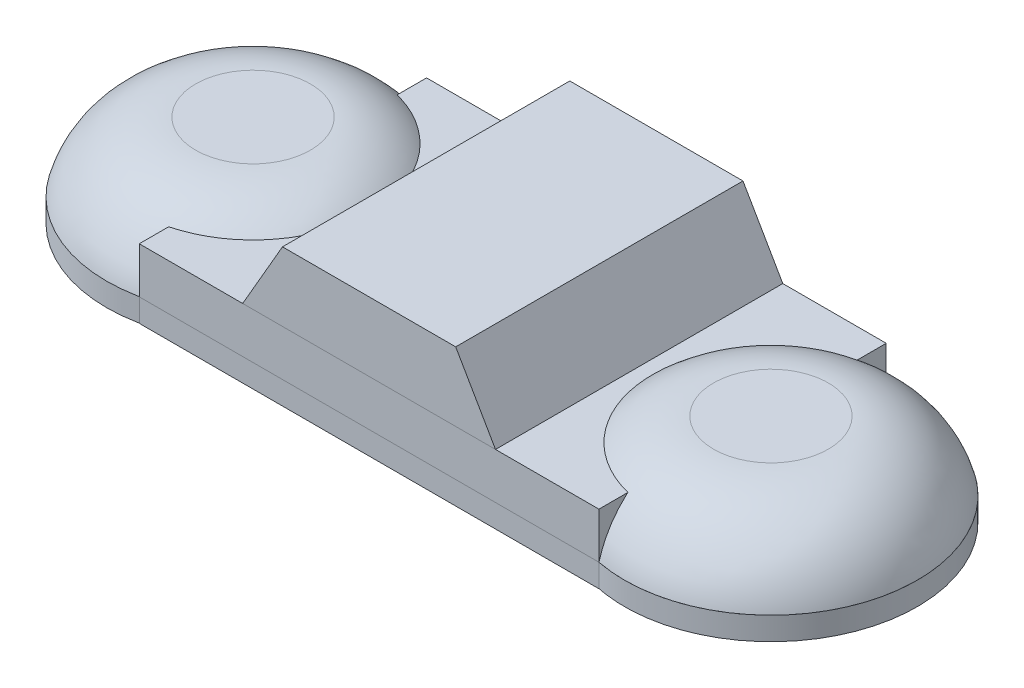
ISO-10303-21;
HEADER;
FILE_DESCRIPTION(('STEP AP214'),'2;1');
FILE_NAME('part.step','',(''),(''),'','','');
FILE_SCHEMA(('AUTOMOTIVE_DESIGN { 1 0 10303 214 1 1 1 1 }'));
ENDSEC;
DATA;
#1=APPLICATION_CONTEXT('core data for automotive mechanical design processes');
#2=APPLICATION_PROTOCOL_DEFINITION('international standard','automotive_design',2000,#1);
#3=PRODUCT_CONTEXT('',#1,'mechanical');
#4=PRODUCT('Part','Part','',(#3));
#5=PRODUCT_RELATED_PRODUCT_CATEGORY('part','',(#4));
#6=PRODUCT_DEFINITION_FORMATION('','',#4);
#7=PRODUCT_DEFINITION_CONTEXT('part definition',#1,'design');
#8=PRODUCT_DEFINITION('design','',#6,#7);
#9=PRODUCT_DEFINITION_SHAPE('','',#8);
#10=(LENGTH_UNIT() NAMED_UNIT(*) SI_UNIT(.MILLI.,.METRE.));
#11=(NAMED_UNIT(*) PLANE_ANGLE_UNIT() SI_UNIT($,.RADIAN.));
#12=(NAMED_UNIT(*) SI_UNIT($,.STERADIAN.) SOLID_ANGLE_UNIT());
#13=UNCERTAINTY_MEASURE_WITH_UNIT(LENGTH_MEASURE(1.E-05),#10,'distance_accuracy_value','');
#14=(GEOMETRIC_REPRESENTATION_CONTEXT(3) GLOBAL_UNCERTAINTY_ASSIGNED_CONTEXT((#13)) GLOBAL_UNIT_ASSIGNED_CONTEXT((#10,
#11,#12)) REPRESENTATION_CONTEXT('',''));
#15=CARTESIAN_POINT('',(0.,0.,0.));
#16=DIRECTION('',(0.,0.,1.));
#17=DIRECTION('',(1.,0.,0.));
#18=AXIS2_PLACEMENT_3D('',#15,#16,#17);
#19=CARTESIAN_POINT('',(0.553239919106996,0.6,-0.620777237110548));
#20=DIRECTION('',(0.,0.,1.));
#21=DIRECTION('',(1.,0.,0.));
#22=AXIS2_PLACEMENT_3D('',#19,#20,#21);
#23=PLANE('',#22);
#24=DIRECTION('',(-1.,0.,0.));
#25=VECTOR('',#24,1.);
#26=CARTESIAN_POINT('',(0.553239919106996,0.3,-0.620777237110548));
#27=LINE('',#26,#25);
#28=CARTESIAN_POINT('',(0.553239919106996,0.3,-0.620777237110548));
#29=VERTEX_POINT('',#28);
#30=CARTESIAN_POINT('',(-0.546760080893004,0.3,-0.620777237110548));
#31=VERTEX_POINT('',#30);
#32=EDGE_CURVE('E91',#29,#31,#27,.T.);
#33=ORIENTED_EDGE('',*,*,#32,.T.);
#34=DIRECTION('',(0.499999999999998,0.86602540378444,0.));
#35=VECTOR('',#34,1.);
#36=CARTESIAN_POINT('',(-0.373555000136117,0.6,-0.620777237110548));
#37=LINE('',#36,#35);
#38=CARTESIAN_POINT('',(-0.373555000136117,0.6,-0.620777237110548));
#39=VERTEX_POINT('',#38);
#40=EDGE_CURVE('E12',#31,#39,#37,.T.);
#41=ORIENTED_EDGE('',*,*,#40,.T.);
#42=DIRECTION('',(-1.,0.,0.));
#43=VECTOR('',#42,1.);
#44=CARTESIAN_POINT('',(0.553239919106996,0.6,-0.620777237110548));
#45=LINE('',#44,#43);
#46=CARTESIAN_POINT('',(0.380034838350108,0.6,-0.620777237110548));
#47=VERTEX_POINT('',#46);
#48=EDGE_CURVE('E113',#47,#39,#45,.T.);
#49=ORIENTED_EDGE('',*,*,#48,.F.);
#50=DIRECTION('',(0.499999999999998,-0.86602540378444,0.));
#51=VECTOR('',#50,1.);
#52=CARTESIAN_POINT('',(0.380034838350108,0.6,-0.620777237110548));
#53=LINE('',#52,#51);
#54=EDGE_CURVE('E53',#47,#29,#53,.T.);
#55=ORIENTED_EDGE('',*,*,#54,.T.);
#56=EDGE_LOOP('',(#33,#41,#49,#55));
#57=FACE_BOUND('',#56,.T.);
#58=ADVANCED_FACE('F45',(#57),#23,.F.);
#59=CARTESIAN_POINT('',(0.553239919106996,0.6,0.629222762889452));
#60=DIRECTION('',(0.,0.,-1.));
#61=DIRECTION('',(-1.,0.,0.));
#62=AXIS2_PLACEMENT_3D('',#59,#60,#61);
#63=PLANE('',#62);
#64=DIRECTION('',(1.,0.,0.));
#65=VECTOR('',#64,1.);
#66=CARTESIAN_POINT('',(0.553239919106996,0.6,0.629222762889452));
#67=LINE('',#66,#65);
#68=CARTESIAN_POINT('',(-0.373555000136116,0.6,0.629222762889452));
#69=VERTEX_POINT('',#68);
#70=CARTESIAN_POINT('',(0.380034838350108,0.6,0.629222762889452));
#71=VERTEX_POINT('',#70);
#72=EDGE_CURVE('E107',#69,#71,#67,.T.);
#73=ORIENTED_EDGE('',*,*,#72,.F.);
#74=DIRECTION('',(-0.499999999999998,-0.86602540378444,0.));
#75=VECTOR('',#74,1.);
#76=CARTESIAN_POINT('',(-0.373555000136116,0.6,0.629222762889452));
#77=LINE('',#76,#75);
#78=CARTESIAN_POINT('',(-0.546760080893004,0.3,0.629222762889452));
#79=VERTEX_POINT('',#78);
#80=EDGE_CURVE('E68',#69,#79,#77,.T.);
#81=ORIENTED_EDGE('',*,*,#80,.T.);
#82=DIRECTION('',(1.,0.,0.));
#83=VECTOR('',#82,1.);
#84=CARTESIAN_POINT('',(0.553239919106996,0.3,0.629222762889452));
#85=LINE('',#84,#83);
#86=CARTESIAN_POINT('',(0.553239919106996,0.3,0.629222762889452));
#87=VERTEX_POINT('',#86);
#88=EDGE_CURVE('E93',#79,#87,#85,.T.);
#89=ORIENTED_EDGE('',*,*,#88,.T.);
#90=DIRECTION('',(-0.499999999999998,0.86602540378444,0.));
#91=VECTOR('',#90,1.);
#92=CARTESIAN_POINT('',(0.380034838350108,0.6,0.629222762889452));
#93=LINE('',#92,#91);
#94=EDGE_CURVE('E60',#87,#71,#93,.T.);
#95=ORIENTED_EDGE('',*,*,#94,.T.);
#96=EDGE_LOOP('',(#73,#81,#89,#95));
#97=FACE_BOUND('',#96,.T.);
#98=ADVANCED_FACE('F111',(#97),#63,.F.);
#99=CARTESIAN_POINT('',(0.,0.6,0.));
#100=DIRECTION('',(0.,1.,0.));
#101=DIRECTION('',(0.,0.,1.));
#102=AXIS2_PLACEMENT_3D('',#99,#100,#101);
#103=PLANE('',#102);
#104=ORIENTED_EDGE('',*,*,#48,.T.);
#105=DIRECTION('',(0.,0.,1.));
#106=VECTOR('',#105,1.);
#107=CARTESIAN_POINT('',(-0.373555000136116,0.6,0.629222762889452));
#108=LINE('',#107,#106);
#109=EDGE_CURVE('E101',#39,#69,#108,.T.);
#110=ORIENTED_EDGE('',*,*,#109,.T.);
#111=ORIENTED_EDGE('',*,*,#72,.T.);
#112=DIRECTION('',(0.,0.,-1.));
#113=VECTOR('',#112,1.);
#114=CARTESIAN_POINT('',(0.380034838350108,0.6,-0.620777237110548));
#115=LINE('',#114,#113);
#116=EDGE_CURVE('E103',#71,#47,#115,.T.);
#117=ORIENTED_EDGE('',*,*,#116,.T.);
#118=EDGE_LOOP('',(#104,#110,#111,#117));
#119=FACE_BOUND('',#118,.T.);
#120=ADVANCED_FACE('F119',(#119),#103,.T.);
#121=CARTESIAN_POINT('',(0.,0.3,0.));
#122=DIRECTION('',(0.,1.,0.));
#123=DIRECTION('',(0.,0.,1.));
#124=AXIS2_PLACEMENT_3D('',#121,#122,#123);
#125=PLANE('',#124);
#126=ORIENTED_EDGE('',*,*,#32,.F.);
#127=DIRECTION('',(0.,0.,-1.));
#128=VECTOR('',#127,1.);
#129=CARTESIAN_POINT('',(0.553239919106996,0.3,0.629222762889452));
#130=LINE('',#129,#128);
#131=EDGE_CURVE('E115',#87,#29,#130,.T.);
#132=ORIENTED_EDGE('',*,*,#131,.F.);
#133=ORIENTED_EDGE('',*,*,#88,.F.);
#134=DIRECTION('',(0.,0.,1.));
#135=VECTOR('',#134,1.);
#136=CARTESIAN_POINT('',(-0.546760080893004,0.3,-0.620777237110548));
#137=LINE('',#136,#135);
#138=EDGE_CURVE('E87',#31,#79,#137,.T.);
#139=ORIENTED_EDGE('',*,*,#138,.F.);
#140=EDGE_LOOP('',(#126,#132,#133,#139));
#141=FACE_BOUND('',#140,.T.);
#142=ADVANCED_FACE('F89',(#141),#125,.F.);
#143=CARTESIAN_POINT('',(-0.373555000136116,0.6,0.));
#144=DIRECTION('',(-0.86602540378444,0.499999999999998,0.));
#145=DIRECTION('',(0.,0.,-1.));
#146=AXIS2_PLACEMENT_3D('',#143,#144,#145);
#147=PLANE('',#146);
#148=ORIENTED_EDGE('',*,*,#40,.F.);
#149=ORIENTED_EDGE('',*,*,#138,.T.);
#150=ORIENTED_EDGE('',*,*,#80,.F.);
#151=ORIENTED_EDGE('',*,*,#109,.F.);
#152=EDGE_LOOP('',(#148,#149,#150,#151));
#153=FACE_BOUND('',#152,.T.);
#154=ADVANCED_FACE('F100',(#153),#147,.T.);
#155=CARTESIAN_POINT('',(0.380034838350108,0.6,0.));
#156=DIRECTION('',(0.86602540378444,0.499999999999998,0.));
#157=DIRECTION('',(0.,0.,1.));
#158=AXIS2_PLACEMENT_3D('',#155,#156,#157);
#159=PLANE('',#158);
#160=ORIENTED_EDGE('',*,*,#94,.F.);
#161=ORIENTED_EDGE('',*,*,#131,.T.);
#162=ORIENTED_EDGE('',*,*,#54,.F.);
#163=ORIENTED_EDGE('',*,*,#116,.F.);
#164=EDGE_LOOP('',(#160,#161,#162,#163));
#165=FACE_BOUND('',#164,.T.);
#166=ADVANCED_FACE('F47',(#165),#159,.T.);
#167=CLOSED_SHELL('',(#58,#98,#120,#142,#154,#166));
#168=MANIFOLD_SOLID_BREP('B2',#167);
#169=CARTESIAN_POINT('',(-1.12663918547376,0.4,0.00422276288945236));
#170=DIRECTION('',(0.,1.,0.));
#171=DIRECTION('',(0.,0.,1.));
#172=AXIS2_PLACEMENT_3D('',#169,#170,#171);
#173=PLANE('',#172);
#174=CARTESIAN_POINT('',(-1.12663918547376,0.4,0.00422276288945236));
#175=DIRECTION('',(0.,1.,0.));
#176=DIRECTION('',(0.,0.,1.));
#177=AXIS2_PLACEMENT_3D('',#174,#175,#176);
#178=CIRCLE('',#177,0.249767108595147);
#179=CARTESIAN_POINT('',(-1.12663918547376,0.4,0.253989871484599));
#180=VERTEX_POINT('',#179);
#181=EDGE_CURVE('E44',#180,#180,#178,.T.);
#182=ORIENTED_EDGE('',*,*,#181,.T.);
#183=EDGE_LOOP('',(#182));
#184=FACE_BOUND('',#183,.T.);
#185=ADVANCED_FACE('F178',(#184),#173,.T.);
#186=CARTESIAN_POINT('',(-1.12663918547376,0.1,0.00422276288945236));
#187=DIRECTION('',(0.,1.,0.));
#188=DIRECTION('',(0.,0.,1.));
#189=AXIS2_PLACEMENT_3D('',#186,#187,#188);
#190=PLANE('',#189);
#191=CARTESIAN_POINT('',(-1.12663918547376,0.1,0.00422276288945236));
#192=DIRECTION('',(0.,1.,0.));
#193=DIRECTION('',(0.,0.,1.));
#194=AXIS2_PLACEMENT_3D('',#191,#192,#193);
#195=CIRCLE('',#194,0.637065443215888);
#196=CARTESIAN_POINT('',(-1.12663918547376,0.1,0.641288206105341));
#197=VERTEX_POINT('',#196);
#198=EDGE_CURVE('E185',#197,#197,#195,.T.);
#199=ORIENTED_EDGE('',*,*,#198,.F.);
#200=EDGE_LOOP('',(#199));
#201=FACE_BOUND('',#200,.T.);
#202=ADVANCED_FACE('F193',(#201),#190,.F.);
#203=CARTESIAN_POINT('',(-1.12663918547376,0.,0.00422276288945236));
#204=DIRECTION('',(0.,-1.,0.));
#205=DIRECTION('',(0.,0.,-1.));
#206=AXIS2_PLACEMENT_3D('',#203,#204,#205);
#207=DEGENERATE_TOROIDAL_SURFACE('',#206,0.249767108595147,0.4,.T.);
#208=ORIENTED_EDGE('',*,*,#198,.T.);
#209=EDGE_LOOP('',(#208));
#210=FACE_BOUND('',#209,.T.);
#211=ORIENTED_EDGE('',*,*,#181,.F.);
#212=EDGE_LOOP('',(#211));
#213=FACE_BOUND('',#212,.T.);
#214=ADVANCED_FACE('F180',(#210,#213),#207,.T.);
#215=CLOSED_SHELL('',(#185,#202,#214));
#216=MANIFOLD_SOLID_BREP('B6',#215);
#217=CARTESIAN_POINT('',(1.12663918547376,0.4,0.00422276288945236));
#218=DIRECTION('',(0.,1.,0.));
#219=DIRECTION('',(0.,0.,1.));
#220=AXIS2_PLACEMENT_3D('',#217,#218,#219);
#221=PLANE('',#220);
#222=CARTESIAN_POINT('',(1.12663918547376,0.4,0.00422276288945236));
#223=DIRECTION('',(0.,1.,0.));
#224=DIRECTION('',(0.,0.,1.));
#225=AXIS2_PLACEMENT_3D('',#222,#223,#224);
#226=CIRCLE('',#225,0.249767108595147);
#227=CARTESIAN_POINT('',(1.12663918547376,0.4,0.253989871484599));
#228=VERTEX_POINT('',#227);
#229=EDGE_CURVE('E177',#228,#228,#226,.T.);
#230=ORIENTED_EDGE('',*,*,#229,.T.);
#231=EDGE_LOOP('',(#230));
#232=FACE_BOUND('',#231,.T.);
#233=ADVANCED_FACE('F228',(#232),#221,.T.);
#234=CARTESIAN_POINT('',(1.12663918547376,0.1,0.00422276288945236));
#235=DIRECTION('',(0.,1.,0.));
#236=DIRECTION('',(0.,0.,1.));
#237=AXIS2_PLACEMENT_3D('',#234,#235,#236);
#238=PLANE('',#237);
#239=CARTESIAN_POINT('',(1.12663918547376,0.1,0.00422276288945236));
#240=DIRECTION('',(0.,1.,0.));
#241=DIRECTION('',(0.,0.,1.));
#242=AXIS2_PLACEMENT_3D('',#239,#240,#241);
#243=CIRCLE('',#242,0.637065443215888);
#244=CARTESIAN_POINT('',(1.12663918547376,0.1,0.641288206105341));
#245=VERTEX_POINT('',#244);
#246=EDGE_CURVE('E235',#245,#245,#243,.T.);
#247=ORIENTED_EDGE('',*,*,#246,.F.);
#248=EDGE_LOOP('',(#247));
#249=FACE_BOUND('',#248,.T.);
#250=ADVANCED_FACE('F243',(#249),#238,.F.);
#251=CARTESIAN_POINT('',(1.12663918547376,0.,0.00422276288945236));
#252=DIRECTION('',(0.,-1.,0.));
#253=DIRECTION('',(0.,0.,-1.));
#254=AXIS2_PLACEMENT_3D('',#251,#252,#253);
#255=DEGENERATE_TOROIDAL_SURFACE('',#254,0.249767108595147,0.4,.T.);
#256=ORIENTED_EDGE('',*,*,#246,.T.);
#257=EDGE_LOOP('',(#256));
#258=FACE_BOUND('',#257,.T.);
#259=ORIENTED_EDGE('',*,*,#229,.F.);
#260=EDGE_LOOP('',(#259));
#261=FACE_BOUND('',#260,.T.);
#262=ADVANCED_FACE('F230',(#258,#261),#255,.T.);
#263=CLOSED_SHELL('',(#233,#250,#262));
#264=MANIFOLD_SOLID_BREP('B39',#263);
#265=CARTESIAN_POINT('',(1.153239919107,0.3,0.00422276288945236));
#266=DIRECTION('',(0.,-1.,0.));
#267=DIRECTION('',(0.,0.,-1.));
#268=AXIS2_PLACEMENT_3D('',#265,#266,#267);
#269=CYLINDRICAL_SURFACE('',#268,0.39999999976948);
#270=CARTESIAN_POINT('',(1.153239919107,0.1,0.00422276288945236));
#271=DIRECTION('',(0.,-1.,0.));
#272=DIRECTION('',(0.,0.,1.));
#273=AXIS2_PLACEMENT_3D('',#270,#271,#272);
#274=CIRCLE('',#273,0.39999999976948);
#275=CARTESIAN_POINT('',(1.003239919107,0.1,0.375032686995569));
#276=VERTEX_POINT('',#275);
#277=CARTESIAN_POINT('',(1.003239919107,0.1,-0.366587161216665));
#278=VERTEX_POINT('',#277);
#279=EDGE_CURVE('E372',#276,#278,#274,.T.);
#280=ORIENTED_EDGE('',*,*,#279,.T.);
#281=DIRECTION('',(0.,-1.,0.));
#282=VECTOR('',#281,1.);
#283=CARTESIAN_POINT('',(1.003239919107,0.3,-0.366587161216665));
#284=LINE('',#283,#282);
#285=CARTESIAN_POINT('',(1.003239919107,0.3,-0.366587161216665));
#286=VERTEX_POINT('',#285);
#287=EDGE_CURVE('E226',#286,#278,#284,.T.);
#288=ORIENTED_EDGE('',*,*,#287,.F.);
#289=CARTESIAN_POINT('',(1.153239919107,0.3,0.00422276288945236));
#290=DIRECTION('',(0.,-1.,0.));
#291=DIRECTION('',(0.,0.,1.));
#292=AXIS2_PLACEMENT_3D('',#289,#290,#291);
#293=CIRCLE('',#292,0.39999999976948);
#294=CARTESIAN_POINT('',(1.003239919107,0.3,0.375032686995569));
#295=VERTEX_POINT('',#294);
#296=EDGE_CURVE('E386',#295,#286,#293,.T.);
#297=ORIENTED_EDGE('',*,*,#296,.F.);
#298=DIRECTION('',(0.,-1.,0.));
#299=VECTOR('',#298,1.);
#300=CARTESIAN_POINT('',(1.003239919107,0.3,0.375032686995569));
#301=LINE('',#300,#299);
#302=EDGE_CURVE('E368',#295,#276,#301,.T.);
#303=ORIENTED_EDGE('',*,*,#302,.T.);
#304=EDGE_LOOP('',(#280,#288,#297,#303));
#305=FACE_BOUND('',#304,.T.);
#306=ADVANCED_FACE('F276',(#305),#269,.F.);
#307=CARTESIAN_POINT('',(1.003239919107,0.3,-0.366587161216665));
#308=DIRECTION('',(-1.,0.,0.));
#309=DIRECTION('',(0.,0.,1.));
#310=AXIS2_PLACEMENT_3D('',#307,#308,#309);
#311=PLANE('',#310);
#312=DIRECTION('',(0.,0.,-1.));
#313=VECTOR('',#312,1.);
#314=CARTESIAN_POINT('',(1.003239919107,0.1,-0.366587161216665));
#315=LINE('',#314,#313);
#316=CARTESIAN_POINT('',(1.003239919107,0.1,-0.620777237110548));
#317=VERTEX_POINT('',#316);
#318=EDGE_CURVE('E375',#278,#317,#315,.T.);
#319=ORIENTED_EDGE('',*,*,#318,.T.);
#320=DIRECTION('',(0.,-1.,0.));
#321=VECTOR('',#320,1.);
#322=CARTESIAN_POINT('',(1.003239919107,0.3,-0.620777237110548));
#323=LINE('',#322,#321);
#324=CARTESIAN_POINT('',(1.003239919107,0.3,-0.620777237110548));
#325=VERTEX_POINT('',#324);
#326=EDGE_CURVE('E284',#325,#317,#323,.T.);
#327=ORIENTED_EDGE('',*,*,#326,.F.);
#328=DIRECTION('',(0.,0.,-1.));
#329=VECTOR('',#328,1.);
#330=CARTESIAN_POINT('',(1.003239919107,0.3,-0.366587161216665));
#331=LINE('',#330,#329);
#332=EDGE_CURVE('E335',#286,#325,#331,.T.);
#333=ORIENTED_EDGE('',*,*,#332,.F.);
#334=ORIENTED_EDGE('',*,*,#287,.T.);
#335=EDGE_LOOP('',(#319,#327,#333,#334));
#336=FACE_BOUND('',#335,.T.);
#337=ADVANCED_FACE('F421',(#336),#311,.F.);
#338=CARTESIAN_POINT('',(1.003239919107,0.3,-0.620777237110548));
#339=DIRECTION('',(0.,0.,1.));
#340=DIRECTION('',(1.,0.,0.));
#341=AXIS2_PLACEMENT_3D('',#338,#339,#340);
#342=PLANE('',#341);
#343=DIRECTION('',(-1.,0.,0.));
#344=VECTOR('',#343,1.);
#345=CARTESIAN_POINT('',(1.003239919107,0.1,-0.620777237110548));
#346=LINE('',#345,#344);
#347=CARTESIAN_POINT('',(-0.996760080893004,0.1,-0.620777237110548));
#348=VERTEX_POINT('',#347);
#349=EDGE_CURVE('E377',#317,#348,#346,.T.);
#350=ORIENTED_EDGE('',*,*,#349,.T.);
#351=DIRECTION('',(0.,-1.,0.));
#352=VECTOR('',#351,1.);
#353=CARTESIAN_POINT('',(-0.996760080893004,0.3,-0.620777237110548));
#354=LINE('',#353,#352);
#355=CARTESIAN_POINT('',(-0.996760080893004,0.3,-0.620777237110548));
#356=VERTEX_POINT('',#355);
#357=EDGE_CURVE('E393',#356,#348,#354,.T.);
#358=ORIENTED_EDGE('',*,*,#357,.F.);
#359=DIRECTION('',(-1.,0.,0.));
#360=VECTOR('',#359,1.);
#361=CARTESIAN_POINT('',(1.003239919107,0.3,-0.620777237110548));
#362=LINE('',#361,#360);
#363=EDGE_CURVE('E401',#325,#356,#362,.T.);
#364=ORIENTED_EDGE('',*,*,#363,.F.);
#365=ORIENTED_EDGE('',*,*,#326,.T.);
#366=EDGE_LOOP('',(#350,#358,#364,#365));
#367=FACE_BOUND('',#366,.T.);
#368=ADVANCED_FACE('F399',(#367),#342,.F.);
#369=CARTESIAN_POINT('',(-0.996760080893004,0.3,-0.620777237110548));
#370=DIRECTION('',(1.,0.,0.));
#371=DIRECTION('',(0.,0.,-1.));
#372=AXIS2_PLACEMENT_3D('',#369,#370,#371);
#373=PLANE('',#372);
#374=DIRECTION('',(0.,0.,1.));
#375=VECTOR('',#374,1.);
#376=CARTESIAN_POINT('',(-0.996760080893004,0.1,-0.620777237110548));
#377=LINE('',#376,#375);
#378=CARTESIAN_POINT('',(-0.996760080893004,0.1,-0.365649228776321));
#379=VERTEX_POINT('',#378);
#380=EDGE_CURVE('E379',#348,#379,#377,.T.);
#381=ORIENTED_EDGE('',*,*,#380,.T.);
#382=DIRECTION('',(0.,-1.,0.));
#383=VECTOR('',#382,1.);
#384=CARTESIAN_POINT('',(-0.996760080893004,0.3,-0.365649228776321));
#385=LINE('',#384,#383);
#386=CARTESIAN_POINT('',(-0.996760080893004,0.3,-0.365649228776321));
#387=VERTEX_POINT('',#386);
#388=EDGE_CURVE('E390',#387,#379,#385,.T.);
#389=ORIENTED_EDGE('',*,*,#388,.F.);
#390=DIRECTION('',(0.,0.,1.));
#391=VECTOR('',#390,1.);
#392=CARTESIAN_POINT('',(-0.996760080893004,0.3,-0.620777237110548));
#393=LINE('',#392,#391);
#394=EDGE_CURVE('E413',#356,#387,#393,.T.);
#395=ORIENTED_EDGE('',*,*,#394,.F.);
#396=ORIENTED_EDGE('',*,*,#357,.T.);
#397=EDGE_LOOP('',(#381,#389,#395,#396));
#398=FACE_BOUND('',#397,.T.);
#399=ADVANCED_FACE('F409',(#398),#373,.F.);
#400=CARTESIAN_POINT('',(-1.146760080893,0.3,0.00422276288945236));
#401=DIRECTION('',(0.,-1.,0.));
#402=DIRECTION('',(0.,0.,-1.));
#403=AXIS2_PLACEMENT_3D('',#400,#401,#402);
#404=CYLINDRICAL_SURFACE('',#403,0.399130668101069);
#405=CARTESIAN_POINT('',(-1.146760080893,0.1,0.00422276288945236));
#406=DIRECTION('',(0.,-1.,0.));
#407=DIRECTION('',(0.,0.,1.));
#408=AXIS2_PLACEMENT_3D('',#405,#406,#407);
#409=CIRCLE('',#408,0.399130668101069);
#410=CARTESIAN_POINT('',(-0.996760080893004,0.1,0.374094754555226));
#411=VERTEX_POINT('',#410);
#412=EDGE_CURVE('E381',#379,#411,#409,.T.);
#413=ORIENTED_EDGE('',*,*,#412,.T.);
#414=DIRECTION('',(0.,-1.,0.));
#415=VECTOR('',#414,1.);
#416=CARTESIAN_POINT('',(-0.996760080893004,0.3,0.374094754555226));
#417=LINE('',#416,#415);
#418=CARTESIAN_POINT('',(-0.996760080893004,0.3,0.374094754555226));
#419=VERTEX_POINT('',#418);
#420=EDGE_CURVE('E363',#419,#411,#417,.T.);
#421=ORIENTED_EDGE('',*,*,#420,.F.);
#422=CARTESIAN_POINT('',(-1.146760080893,0.3,0.00422276288945236));
#423=DIRECTION('',(0.,-1.,0.));
#424=DIRECTION('',(0.,0.,1.));
#425=AXIS2_PLACEMENT_3D('',#422,#423,#424);
#426=CIRCLE('',#425,0.399130668101069);
#427=EDGE_CURVE('E354',#387,#419,#426,.T.);
#428=ORIENTED_EDGE('',*,*,#427,.F.);
#429=ORIENTED_EDGE('',*,*,#388,.T.);
#430=EDGE_LOOP('',(#413,#421,#428,#429));
#431=FACE_BOUND('',#430,.T.);
#432=ADVANCED_FACE('F412',(#431),#404,.F.);
#433=CARTESIAN_POINT('',(-0.996760080893004,0.3,0.374094754555226));
#434=DIRECTION('',(1.,0.,0.));
#435=DIRECTION('',(0.,0.,-1.));
#436=AXIS2_PLACEMENT_3D('',#433,#434,#435);
#437=PLANE('',#436);
#438=DIRECTION('',(0.,0.,1.));
#439=VECTOR('',#438,1.);
#440=CARTESIAN_POINT('',(-0.996760080893004,0.1,0.374094754555226));
#441=LINE('',#440,#439);
#442=CARTESIAN_POINT('',(-0.996760080893004,0.1,0.629222762889452));
#443=VERTEX_POINT('',#442);
#444=EDGE_CURVE('E362',#411,#443,#441,.T.);
#445=ORIENTED_EDGE('',*,*,#444,.T.);
#446=DIRECTION('',(0.,-1.,0.));
#447=VECTOR('',#446,1.);
#448=CARTESIAN_POINT('',(-0.996760080893004,0.3,0.629222762889452));
#449=LINE('',#448,#447);
#450=CARTESIAN_POINT('',(-0.996760080893004,0.3,0.629222762889452));
#451=VERTEX_POINT('',#450);
#452=EDGE_CURVE('E359',#451,#443,#449,.T.);
#453=ORIENTED_EDGE('',*,*,#452,.F.);
#454=DIRECTION('',(0.,0.,1.));
#455=VECTOR('',#454,1.);
#456=CARTESIAN_POINT('',(-0.996760080893004,0.3,0.374094754555226));
#457=LINE('',#456,#455);
#458=EDGE_CURVE('E348',#419,#451,#457,.T.);
#459=ORIENTED_EDGE('',*,*,#458,.F.);
#460=ORIENTED_EDGE('',*,*,#420,.T.);
#461=EDGE_LOOP('',(#445,#453,#459,#460));
#462=FACE_BOUND('',#461,.T.);
#463=ADVANCED_FACE('F360',(#462),#437,.F.);
#464=CARTESIAN_POINT('',(-0.996760080893004,0.3,0.629222762889452));
#465=DIRECTION('',(0.,0.,-1.));
#466=DIRECTION('',(-1.,0.,0.));
#467=AXIS2_PLACEMENT_3D('',#464,#465,#466);
#468=PLANE('',#467);
#469=DIRECTION('',(1.,0.,0.));
#470=VECTOR('',#469,1.);
#471=CARTESIAN_POINT('',(-0.996760080893004,0.1,0.629222762889452));
#472=LINE('',#471,#470);
#473=CARTESIAN_POINT('',(1.003239919107,0.1,0.629222762889452));
#474=VERTEX_POINT('',#473);
#475=EDGE_CURVE('E321',#443,#474,#472,.T.);
#476=ORIENTED_EDGE('',*,*,#475,.T.);
#477=DIRECTION('',(0.,-1.,0.));
#478=VECTOR('',#477,1.);
#479=CARTESIAN_POINT('',(1.003239919107,0.3,0.629222762889452));
#480=LINE('',#479,#478);
#481=CARTESIAN_POINT('',(1.003239919107,0.3,0.629222762889452));
#482=VERTEX_POINT('',#481);
#483=EDGE_CURVE('E364',#482,#474,#480,.T.);
#484=ORIENTED_EDGE('',*,*,#483,.F.);
#485=DIRECTION('',(1.,0.,0.));
#486=VECTOR('',#485,1.);
#487=CARTESIAN_POINT('',(-0.996760080893004,0.3,0.629222762889452));
#488=LINE('',#487,#486);
#489=EDGE_CURVE('E352',#451,#482,#488,.T.);
#490=ORIENTED_EDGE('',*,*,#489,.F.);
#491=ORIENTED_EDGE('',*,*,#452,.T.);
#492=EDGE_LOOP('',(#476,#484,#490,#491));
#493=FACE_BOUND('',#492,.T.);
#494=ADVANCED_FACE('F366',(#493),#468,.F.);
#495=CARTESIAN_POINT('',(1.003239919107,0.3,0.629222762889452));
#496=DIRECTION('',(-1.,0.,0.));
#497=DIRECTION('',(0.,0.,1.));
#498=AXIS2_PLACEMENT_3D('',#495,#496,#497);
#499=PLANE('',#498);
#500=DIRECTION('',(0.,0.,-1.));
#501=VECTOR('',#500,1.);
#502=CARTESIAN_POINT('',(1.003239919107,0.1,0.629222762889452));
#503=LINE('',#502,#501);
#504=EDGE_CURVE('E327',#474,#276,#503,.T.);
#505=ORIENTED_EDGE('',*,*,#504,.T.);
#506=ORIENTED_EDGE('',*,*,#302,.F.);
#507=DIRECTION('',(0.,0.,-1.));
#508=VECTOR('',#507,1.);
#509=CARTESIAN_POINT('',(1.003239919107,0.3,0.629222762889452));
#510=LINE('',#509,#508);
#511=EDGE_CURVE('E292',#482,#295,#510,.T.);
#512=ORIENTED_EDGE('',*,*,#511,.F.);
#513=ORIENTED_EDGE('',*,*,#483,.T.);
#514=EDGE_LOOP('',(#505,#506,#512,#513));
#515=FACE_BOUND('',#514,.T.);
#516=ADVANCED_FACE('F437',(#515),#499,.F.);
#517=CARTESIAN_POINT('',(1.153239919107,0.3,0.00422276288945236));
#518=DIRECTION('',(0.,1.,0.));
#519=DIRECTION('',(0.,0.,1.));
#520=AXIS2_PLACEMENT_3D('',#517,#518,#519);
#521=PLANE('',#520);
#522=ORIENTED_EDGE('',*,*,#296,.T.);
#523=ORIENTED_EDGE('',*,*,#332,.T.);
#524=ORIENTED_EDGE('',*,*,#363,.T.);
#525=ORIENTED_EDGE('',*,*,#394,.T.);
#526=ORIENTED_EDGE('',*,*,#427,.T.);
#527=ORIENTED_EDGE('',*,*,#458,.T.);
#528=ORIENTED_EDGE('',*,*,#489,.T.);
#529=ORIENTED_EDGE('',*,*,#511,.T.);
#530=EDGE_LOOP('',(#522,#523,#524,#525,#526,#527,#528,#529));
#531=FACE_BOUND('',#530,.T.);
#532=ADVANCED_FACE('F350',(#531),#521,.T.);
#533=CARTESIAN_POINT('',(1.153239919107,0.1,0.00422276288945236));
#534=DIRECTION('',(0.,1.,0.));
#535=DIRECTION('',(0.,0.,1.));
#536=AXIS2_PLACEMENT_3D('',#533,#534,#535);
#537=PLANE('',#536);
#538=ORIENTED_EDGE('',*,*,#279,.F.);
#539=ORIENTED_EDGE('',*,*,#504,.F.);
#540=ORIENTED_EDGE('',*,*,#475,.F.);
#541=ORIENTED_EDGE('',*,*,#444,.F.);
#542=ORIENTED_EDGE('',*,*,#412,.F.);
#543=ORIENTED_EDGE('',*,*,#380,.F.);
#544=ORIENTED_EDGE('',*,*,#349,.F.);
#545=ORIENTED_EDGE('',*,*,#318,.F.);
#546=EDGE_LOOP('',(#538,#539,#540,#541,#542,#543,#544,#545));
#547=FACE_BOUND('',#546,.T.);
#548=ADVANCED_FACE('F405',(#547),#537,.F.);
#549=CLOSED_SHELL('',(#306,#337,#368,#399,#432,#463,#494,#516,#532,#548));
#550=MANIFOLD_SOLID_BREP('B172',#549);
#551=CARTESIAN_POINT('',(1.12663918547376,0.1,0.00422276288945236));
#552=DIRECTION('',(0.,-1.,0.));
#553=DIRECTION('',(0.,0.,-1.));
#554=AXIS2_PLACEMENT_3D('',#551,#552,#553);
#555=CYLINDRICAL_SURFACE('',#554,0.637065443215888);
#556=CARTESIAN_POINT('',(1.12663918547376,0.1,0.00422276288945236));
#557=DIRECTION('',(0.,-1.,0.));
#558=DIRECTION('',(0.,0.,-1.));
#559=AXIS2_PLACEMENT_3D('',#556,#557,#558);
#560=CIRCLE('',#559,0.637065443215888);
#561=CARTESIAN_POINT('',(1.12663918547376,0.1,-0.632842680326436));
#562=VERTEX_POINT('',#561);
#563=EDGE_CURVE('E275',#562,#562,#560,.T.);
#564=ORIENTED_EDGE('',*,*,#563,.T.);
#565=EDGE_LOOP('',(#564));
#566=FACE_BOUND('',#565,.T.);
#567=CARTESIAN_POINT('',(1.12663918547376,0.,0.00422276288945236));
#568=DIRECTION('',(0.,-1.,0.));
#569=DIRECTION('',(0.,0.,-1.));
#570=AXIS2_PLACEMENT_3D('',#567,#568,#569);
#571=CIRCLE('',#570,0.637065443215888);
#572=CARTESIAN_POINT('',(1.12663918547376,0.,-0.632842680326436));
#573=VERTEX_POINT('',#572);
#574=EDGE_CURVE('E514',#573,#573,#571,.T.);
#575=ORIENTED_EDGE('',*,*,#574,.F.);
#576=EDGE_LOOP('',(#575));
#577=FACE_BOUND('',#576,.T.);
#578=ADVANCED_FACE('F511',(#566,#577),#555,.T.);
#579=CARTESIAN_POINT('',(1.12663918547376,0.1,0.00422276288945236));
#580=DIRECTION('',(0.,-1.,0.));
#581=DIRECTION('',(0.,0.,-1.));
#582=AXIS2_PLACEMENT_3D('',#579,#580,#581);
#583=PLANE('',#582);
#584=ORIENTED_EDGE('',*,*,#563,.F.);
#585=EDGE_LOOP('',(#584));
#586=FACE_BOUND('',#585,.T.);
#587=ADVANCED_FACE('F526',(#586),#583,.F.);
#588=CARTESIAN_POINT('',(1.12663918547376,0.,0.00422276288945236));
#589=DIRECTION('',(0.,-1.,0.));
#590=DIRECTION('',(0.,0.,-1.));
#591=AXIS2_PLACEMENT_3D('',#588,#589,#590);
#592=PLANE('',#591);
#593=ORIENTED_EDGE('',*,*,#574,.T.);
#594=EDGE_LOOP('',(#593));
#595=FACE_BOUND('',#594,.T.);
#596=ADVANCED_FACE('F523',(#595),#592,.T.);
#597=CLOSED_SHELL('',(#578,#587,#596));
#598=MANIFOLD_SOLID_BREP('B220',#597);
#599=CARTESIAN_POINT('',(-1.12663918547376,0.1,0.00422276288945236));
#600=DIRECTION('',(0.,-1.,0.));
#601=DIRECTION('',(0.,0.,-1.));
#602=AXIS2_PLACEMENT_3D('',#599,#600,#601);
#603=CYLINDRICAL_SURFACE('',#602,0.637065443215888);
#604=CARTESIAN_POINT('',(-1.12663918547376,0.1,0.00422276288945236));
#605=DIRECTION('',(0.,-1.,0.));
#606=DIRECTION('',(0.,0.,1.));
#607=AXIS2_PLACEMENT_3D('',#604,#605,#606);
#608=CIRCLE('',#607,0.637065443215888);
#609=CARTESIAN_POINT('',(-1.12663918547376,0.1,0.641288206105341));
#610=VERTEX_POINT('',#609);
#611=EDGE_CURVE('E510',#610,#610,#608,.T.);
#612=ORIENTED_EDGE('',*,*,#611,.T.);
#613=EDGE_LOOP('',(#612));
#614=FACE_BOUND('',#613,.T.);
#615=CARTESIAN_POINT('',(-1.12663918547376,0.,0.00422276288945236));
#616=DIRECTION('',(0.,-1.,0.));
#617=DIRECTION('',(0.,0.,1.));
#618=AXIS2_PLACEMENT_3D('',#615,#616,#617);
#619=CIRCLE('',#618,0.637065443215888);
#620=CARTESIAN_POINT('',(-1.12663918547376,0.,0.641288206105341));
#621=VERTEX_POINT('',#620);
#622=EDGE_CURVE('E563',#621,#621,#619,.T.);
#623=ORIENTED_EDGE('',*,*,#622,.F.);
#624=EDGE_LOOP('',(#623));
#625=FACE_BOUND('',#624,.T.);
#626=ADVANCED_FACE('F560',(#614,#625),#603,.T.);
#627=CARTESIAN_POINT('',(-1.12663918547376,0.1,0.00422276288945236));
#628=DIRECTION('',(0.,1.,0.));
#629=DIRECTION('',(0.,0.,1.));
#630=AXIS2_PLACEMENT_3D('',#627,#628,#629);
#631=PLANE('',#630);
#632=ORIENTED_EDGE('',*,*,#611,.F.);
#633=EDGE_LOOP('',(#632));
#634=FACE_BOUND('',#633,.T.);
#635=ADVANCED_FACE('F575',(#634),#631,.T.);
#636=CARTESIAN_POINT('',(-1.12663918547376,0.,0.00422276288945236));
#637=DIRECTION('',(0.,1.,0.));
#638=DIRECTION('',(0.,0.,1.));
#639=AXIS2_PLACEMENT_3D('',#636,#637,#638);
#640=PLANE('',#639);
#641=ORIENTED_EDGE('',*,*,#622,.T.);
#642=EDGE_LOOP('',(#641));
#643=FACE_BOUND('',#642,.T.);
#644=ADVANCED_FACE('F572',(#643),#640,.F.);
#645=CLOSED_SHELL('',(#626,#635,#644));
#646=MANIFOLD_SOLID_BREP('B270',#645);
#647=CARTESIAN_POINT('',(1.153239919107,0.1,0.00422276288945236));
#648=DIRECTION('',(0.,-1.,0.));
#649=DIRECTION('',(0.,0.,-1.));
#650=AXIS2_PLACEMENT_3D('',#647,#648,#649);
#651=CYLINDRICAL_SURFACE('',#650,0.39999999976948);
#652=CARTESIAN_POINT('',(1.153239919107,0.,0.00422276288945236));
#653=DIRECTION('',(0.,1.,0.));
#654=DIRECTION('',(0.,0.,1.));
#655=AXIS2_PLACEMENT_3D('',#652,#653,#654);
#656=CIRCLE('',#655,0.39999999976948);
#657=CARTESIAN_POINT('',(1.003239919107,0.,-0.366587161216665));
#658=VERTEX_POINT('',#657);
#659=CARTESIAN_POINT('',(1.003239919107,0.,0.375032686995569));
#660=VERTEX_POINT('',#659);
#661=EDGE_CURVE('E695',#658,#660,#656,.T.);
#662=ORIENTED_EDGE('',*,*,#661,.F.);
#663=DIRECTION('',(0.,-1.,0.));
#664=VECTOR('',#663,1.);
#665=CARTESIAN_POINT('',(1.003239919107,0.1,-0.366587161216665));
#666=LINE('',#665,#664);
#667=CARTESIAN_POINT('',(1.003239919107,0.1,-0.366587161216665));
#668=VERTEX_POINT('',#667);
#669=EDGE_CURVE('E558',#668,#658,#666,.T.);
#670=ORIENTED_EDGE('',*,*,#669,.F.);
#671=CARTESIAN_POINT('',(1.153239919107,0.1,0.00422276288945236));
#672=DIRECTION('',(0.,1.,0.));
#673=DIRECTION('',(0.,0.,1.));
#674=AXIS2_PLACEMENT_3D('',#671,#672,#673);
#675=CIRCLE('',#674,0.39999999976948);
#676=CARTESIAN_POINT('',(1.003239919107,0.1,0.375032686995569));
#677=VERTEX_POINT('',#676);
#678=EDGE_CURVE('E713',#668,#677,#675,.T.);
#679=ORIENTED_EDGE('',*,*,#678,.T.);
#680=DIRECTION('',(0.,-1.,0.));
#681=VECTOR('',#680,1.);
#682=CARTESIAN_POINT('',(1.003239919107,0.1,0.375032686995569));
#683=LINE('',#682,#681);
#684=EDGE_CURVE('E616',#677,#660,#683,.T.);
#685=ORIENTED_EDGE('',*,*,#684,.T.);
#686=EDGE_LOOP('',(#662,#670,#679,#685));
#687=FACE_BOUND('',#686,.T.);
#688=ADVANCED_FACE('F600',(#687),#651,.F.);
#689=CARTESIAN_POINT('',(1.003239919107,0.1,0.));
#690=DIRECTION('',(-1.,0.,0.));
#691=DIRECTION('',(0.,0.,1.));
#692=AXIS2_PLACEMENT_3D('',#689,#690,#691);
#693=PLANE('',#692);
#694=DIRECTION('',(0.,0.,-1.));
#695=VECTOR('',#694,1.);
#696=CARTESIAN_POINT('',(1.003239919107,0.,0.));
#697=LINE('',#696,#695);
#698=CARTESIAN_POINT('',(1.003239919107,0.,-0.620777237110548));
#699=VERTEX_POINT('',#698);
#700=EDGE_CURVE('E697',#658,#699,#697,.T.);
#701=ORIENTED_EDGE('',*,*,#700,.T.);
#702=DIRECTION('',(0.,-1.,0.));
#703=VECTOR('',#702,1.);
#704=CARTESIAN_POINT('',(1.003239919107,0.1,-0.620777237110548));
#705=LINE('',#704,#703);
#706=CARTESIAN_POINT('',(1.003239919107,0.1,-0.620777237110548));
#707=VERTEX_POINT('',#706);
#708=EDGE_CURVE('E608',#707,#699,#705,.T.);
#709=ORIENTED_EDGE('',*,*,#708,.F.);
#710=DIRECTION('',(0.,0.,-1.));
#711=VECTOR('',#710,1.);
#712=CARTESIAN_POINT('',(1.003239919107,0.1,0.));
#713=LINE('',#712,#711);
#714=EDGE_CURVE('E739',#668,#707,#713,.T.);
#715=ORIENTED_EDGE('',*,*,#714,.F.);
#716=ORIENTED_EDGE('',*,*,#669,.T.);
#717=EDGE_LOOP('',(#701,#709,#715,#716));
#718=FACE_BOUND('',#717,.T.);
#719=ADVANCED_FACE('F754',(#718),#693,.F.);
#720=CARTESIAN_POINT('',(0.,0.1,-0.620777237110548));
#721=DIRECTION('',(0.,0.,1.));
#722=DIRECTION('',(1.,0.,0.));
#723=AXIS2_PLACEMENT_3D('',#720,#721,#722);
#724=PLANE('',#723);
#725=DIRECTION('',(-1.,0.,0.));
#726=VECTOR('',#725,1.);
#727=CARTESIAN_POINT('',(0.,0.,-0.620777237110548));
#728=LINE('',#727,#726);
#729=CARTESIAN_POINT('',(-0.996760080893004,0.,-0.620777237110548));
#730=VERTEX_POINT('',#729);
#731=EDGE_CURVE('E699',#699,#730,#728,.T.);
#732=ORIENTED_EDGE('',*,*,#731,.T.);
#733=DIRECTION('',(0.,-1.,0.));
#734=VECTOR('',#733,1.);
#735=CARTESIAN_POINT('',(-0.996760080893004,0.1,-0.620777237110548));
#736=LINE('',#735,#734);
#737=CARTESIAN_POINT('',(-0.996760080893004,0.1,-0.620777237110548));
#738=VERTEX_POINT('',#737);
#739=EDGE_CURVE('E719',#738,#730,#736,.T.);
#740=ORIENTED_EDGE('',*,*,#739,.F.);
#741=DIRECTION('',(-1.,0.,0.));
#742=VECTOR('',#741,1.);
#743=CARTESIAN_POINT('',(0.,0.1,-0.620777237110548));
#744=LINE('',#743,#742);
#745=EDGE_CURVE('E728',#707,#738,#744,.T.);
#746=ORIENTED_EDGE('',*,*,#745,.F.);
#747=ORIENTED_EDGE('',*,*,#708,.T.);
#748=EDGE_LOOP('',(#732,#740,#746,#747));
#749=FACE_BOUND('',#748,.T.);
#750=ADVANCED_FACE('F726',(#749),#724,.F.);
#751=CARTESIAN_POINT('',(-0.996760080893004,0.1,0.));
#752=DIRECTION('',(1.,0.,0.));
#753=DIRECTION('',(0.,0.,-1.));
#754=AXIS2_PLACEMENT_3D('',#751,#752,#753);
#755=PLANE('',#754);
#756=DIRECTION('',(0.,0.,1.));
#757=VECTOR('',#756,1.);
#758=CARTESIAN_POINT('',(-0.996760080893004,0.,0.));
#759=LINE('',#758,#757);
#760=CARTESIAN_POINT('',(-0.996760080893004,0.,-0.365649228776321));
#761=VERTEX_POINT('',#760);
#762=EDGE_CURVE('E701',#730,#761,#759,.T.);
#763=ORIENTED_EDGE('',*,*,#762,.T.);
#764=DIRECTION('',(0.,-1.,0.));
#765=VECTOR('',#764,1.);
#766=CARTESIAN_POINT('',(-0.996760080893004,0.1,-0.365649228776321));
#767=LINE('',#766,#765);
#768=CARTESIAN_POINT('',(-0.996760080893004,0.1,-0.365649228776321));
#769=VERTEX_POINT('',#768);
#770=EDGE_CURVE('E717',#769,#761,#767,.T.);
#771=ORIENTED_EDGE('',*,*,#770,.F.);
#772=DIRECTION('',(0.,0.,1.));
#773=VECTOR('',#772,1.);
#774=CARTESIAN_POINT('',(-0.996760080893004,0.1,0.));
#775=LINE('',#774,#773);
#776=EDGE_CURVE('E690',#738,#769,#775,.T.);
#777=ORIENTED_EDGE('',*,*,#776,.F.);
#778=ORIENTED_EDGE('',*,*,#739,.T.);
#779=EDGE_LOOP('',(#763,#771,#777,#778));
#780=FACE_BOUND('',#779,.T.);
#781=ADVANCED_FACE('F737',(#780),#755,.F.);
#782=CARTESIAN_POINT('',(-1.146760080893,0.1,0.00422276288945236));
#783=DIRECTION('',(0.,-1.,0.));
#784=DIRECTION('',(0.,0.,-1.));
#785=AXIS2_PLACEMENT_3D('',#782,#783,#784);
#786=CYLINDRICAL_SURFACE('',#785,0.399130668101069);
#787=CARTESIAN_POINT('',(-1.146760080893,0.,0.00422276288945236));
#788=DIRECTION('',(0.,1.,0.));
#789=DIRECTION('',(0.,0.,1.));
#790=AXIS2_PLACEMENT_3D('',#787,#788,#789);
#791=CIRCLE('',#790,0.399130668101069);
#792=CARTESIAN_POINT('',(-0.996760080893004,0.,0.374094754555226));
#793=VERTEX_POINT('',#792);
#794=EDGE_CURVE('E704',#793,#761,#791,.T.);
#795=ORIENTED_EDGE('',*,*,#794,.F.);
#796=DIRECTION('',(0.,-1.,0.));
#797=VECTOR('',#796,1.);
#798=CARTESIAN_POINT('',(-0.996760080893004,0.1,0.374094754555226));
#799=LINE('',#798,#797);
#800=CARTESIAN_POINT('',(-0.996760080893004,0.1,0.374094754555226));
#801=VERTEX_POINT('',#800);
#802=EDGE_CURVE('E676',#801,#793,#799,.T.);
#803=ORIENTED_EDGE('',*,*,#802,.F.);
#804=CARTESIAN_POINT('',(-1.146760080893,0.1,0.00422276288945236));
#805=DIRECTION('',(0.,1.,0.));
#806=DIRECTION('',(0.,0.,1.));
#807=AXIS2_PLACEMENT_3D('',#804,#805,#806);
#808=CIRCLE('',#807,0.399130668101069);
#809=EDGE_CURVE('E688',#801,#769,#808,.T.);
#810=ORIENTED_EDGE('',*,*,#809,.T.);
#811=ORIENTED_EDGE('',*,*,#770,.T.);
#812=EDGE_LOOP('',(#795,#803,#810,#811));
#813=FACE_BOUND('',#812,.T.);
#814=ADVANCED_FACE('F765',(#813),#786,.F.);
#815=CARTESIAN_POINT('',(-0.996760080893004,0.1,0.));
#816=DIRECTION('',(-1.,0.,0.));
#817=DIRECTION('',(0.,0.,1.));
#818=AXIS2_PLACEMENT_3D('',#815,#816,#817);
#819=PLANE('',#818);
#820=DIRECTION('',(0.,0.,-1.));
#821=VECTOR('',#820,1.);
#822=CARTESIAN_POINT('',(-0.996760080893004,0.,0.));
#823=LINE('',#822,#821);
#824=CARTESIAN_POINT('',(-0.996760080893004,0.,0.629222762889452));
#825=VERTEX_POINT('',#824);
#826=EDGE_CURVE('E673',#825,#793,#823,.T.);
#827=ORIENTED_EDGE('',*,*,#826,.F.);
#828=DIRECTION('',(0.,-1.,0.));
#829=VECTOR('',#828,1.);
#830=CARTESIAN_POINT('',(-0.996760080893004,0.1,0.629222762889452));
#831=LINE('',#830,#829);
#832=CARTESIAN_POINT('',(-0.996760080893004,0.1,0.629222762889452));
#833=VERTEX_POINT('',#832);
#834=EDGE_CURVE('E667',#833,#825,#831,.T.);
#835=ORIENTED_EDGE('',*,*,#834,.F.);
#836=DIRECTION('',(0.,0.,-1.));
#837=VECTOR('',#836,1.);
#838=CARTESIAN_POINT('',(-0.996760080893004,0.1,0.));
#839=LINE('',#838,#837);
#840=EDGE_CURVE('E671',#833,#801,#839,.T.);
#841=ORIENTED_EDGE('',*,*,#840,.T.);
#842=ORIENTED_EDGE('',*,*,#802,.T.);
#843=EDGE_LOOP('',(#827,#835,#841,#842));
#844=FACE_BOUND('',#843,.T.);
#845=ADVANCED_FACE('F669',(#844),#819,.T.);
#846=CARTESIAN_POINT('',(0.,0.1,0.629222762889452));
#847=DIRECTION('',(0.,0.,-1.));
#848=DIRECTION('',(-1.,0.,0.));
#849=AXIS2_PLACEMENT_3D('',#846,#847,#848);
#850=PLANE('',#849);
#851=DIRECTION('',(1.,0.,0.));
#852=VECTOR('',#851,1.);
#853=CARTESIAN_POINT('',(0.,0.,0.629222762889452));
#854=LINE('',#853,#852);
#855=CARTESIAN_POINT('',(1.003239919107,0.,0.629222762889452));
#856=VERTEX_POINT('',#855);
#857=EDGE_CURVE('E708',#825,#856,#854,.T.);
#858=ORIENTED_EDGE('',*,*,#857,.T.);
#859=DIRECTION('',(0.,-1.,0.));
#860=VECTOR('',#859,1.);
#861=CARTESIAN_POINT('',(1.003239919107,0.1,0.629222762889452));
#862=LINE('',#861,#860);
#863=CARTESIAN_POINT('',(1.003239919107,0.1,0.629222762889452));
#864=VERTEX_POINT('',#863);
#865=EDGE_CURVE('E642',#864,#856,#862,.T.);
#866=ORIENTED_EDGE('',*,*,#865,.F.);
#867=DIRECTION('',(1.,0.,0.));
#868=VECTOR('',#867,1.);
#869=CARTESIAN_POINT('',(0.,0.1,0.629222762889452));
#870=LINE('',#869,#868);
#871=EDGE_CURVE('E678',#833,#864,#870,.T.);
#872=ORIENTED_EDGE('',*,*,#871,.F.);
#873=ORIENTED_EDGE('',*,*,#834,.T.);
#874=EDGE_LOOP('',(#858,#866,#872,#873));
#875=FACE_BOUND('',#874,.T.);
#876=ADVANCED_FACE('F679',(#875),#850,.F.);
#877=CARTESIAN_POINT('',(1.003239919107,0.1,0.));
#878=DIRECTION('',(1.,0.,0.));
#879=DIRECTION('',(0.,0.,-1.));
#880=AXIS2_PLACEMENT_3D('',#877,#878,#879);
#881=PLANE('',#880);
#882=DIRECTION('',(0.,0.,1.));
#883=VECTOR('',#882,1.);
#884=CARTESIAN_POINT('',(1.003239919107,0.,0.));
#885=LINE('',#884,#883);
#886=EDGE_CURVE('E710',#660,#856,#885,.T.);
#887=ORIENTED_EDGE('',*,*,#886,.F.);
#888=ORIENTED_EDGE('',*,*,#684,.F.);
#889=DIRECTION('',(0.,0.,1.));
#890=VECTOR('',#889,1.);
#891=CARTESIAN_POINT('',(1.003239919107,0.1,0.));
#892=LINE('',#891,#890);
#893=EDGE_CURVE('E682',#677,#864,#892,.T.);
#894=ORIENTED_EDGE('',*,*,#893,.T.);
#895=ORIENTED_EDGE('',*,*,#865,.T.);
#896=EDGE_LOOP('',(#887,#888,#894,#895));
#897=FACE_BOUND('',#896,.T.);
#898=ADVANCED_FACE('F743',(#897),#881,.T.);
#899=CARTESIAN_POINT('',(0.,0.1,0.));
#900=DIRECTION('',(0.,1.,0.));
#901=DIRECTION('',(0.,0.,1.));
#902=AXIS2_PLACEMENT_3D('',#899,#900,#901);
#903=PLANE('',#902);
#904=ORIENTED_EDGE('',*,*,#678,.F.);
#905=ORIENTED_EDGE('',*,*,#714,.T.);
#906=ORIENTED_EDGE('',*,*,#745,.T.);
#907=ORIENTED_EDGE('',*,*,#776,.T.);
#908=ORIENTED_EDGE('',*,*,#809,.F.);
#909=ORIENTED_EDGE('',*,*,#840,.F.);
#910=ORIENTED_EDGE('',*,*,#871,.T.);
#911=ORIENTED_EDGE('',*,*,#893,.F.);
#912=EDGE_LOOP('',(#904,#905,#906,#907,#908,#909,#910,#911));
#913=FACE_BOUND('',#912,.T.);
#914=ADVANCED_FACE('F686',(#913),#903,.T.);
#915=CARTESIAN_POINT('',(0.,0.,0.));
#916=DIRECTION('',(0.,1.,0.));
#917=DIRECTION('',(0.,0.,1.));
#918=AXIS2_PLACEMENT_3D('',#915,#916,#917);
#919=PLANE('',#918);
#920=ORIENTED_EDGE('',*,*,#661,.T.);
#921=ORIENTED_EDGE('',*,*,#886,.T.);
#922=ORIENTED_EDGE('',*,*,#857,.F.);
#923=ORIENTED_EDGE('',*,*,#826,.T.);
#924=ORIENTED_EDGE('',*,*,#794,.T.);
#925=ORIENTED_EDGE('',*,*,#762,.F.);
#926=ORIENTED_EDGE('',*,*,#731,.F.);
#927=ORIENTED_EDGE('',*,*,#700,.F.);
#928=EDGE_LOOP('',(#920,#921,#922,#923,#924,#925,#926,#927));
#929=FACE_BOUND('',#928,.T.);
#930=ADVANCED_FACE('F733',(#929),#919,.F.);
#931=CLOSED_SHELL('',(#688,#719,#750,#781,#814,#845,#876,#898,#914,#930));
#932=MANIFOLD_SOLID_BREP('B505',#931);
#933=ADVANCED_BREP_SHAPE_REPRESENTATION('',(#18,#168,#216,#264,#550,#598,#646,#932),#14);
#934=SHAPE_DEFINITION_REPRESENTATION(#9,#933);
ENDSEC;
END-ISO-10303-21;
